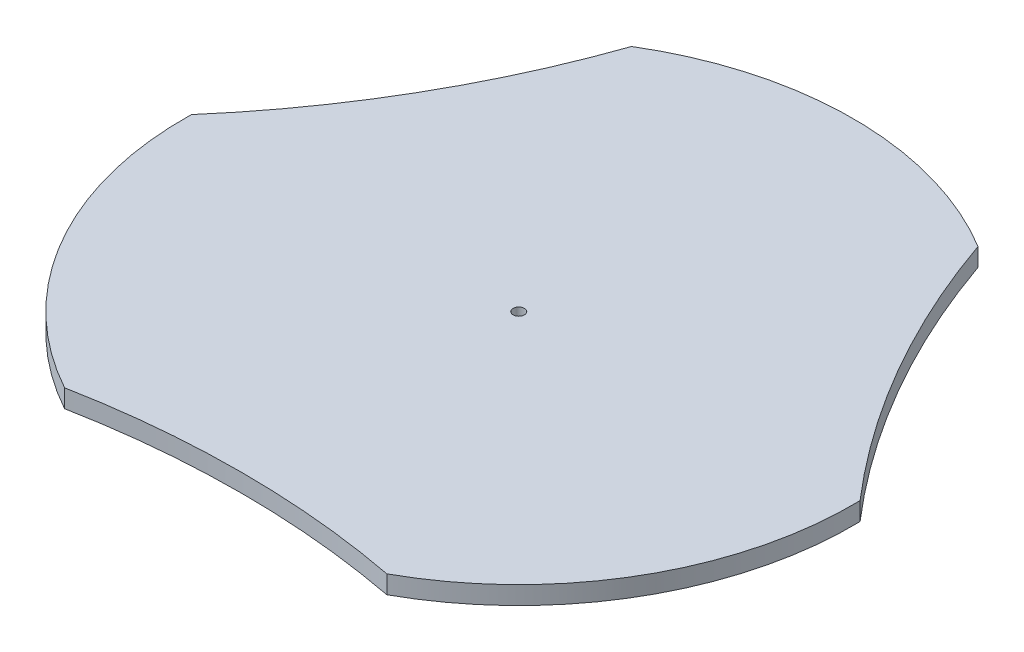
ISO-10303-21;
HEADER;
FILE_DESCRIPTION(('STEP AP214'),'2;1');
FILE_NAME('part.step','',(''),(''),'','','');
FILE_SCHEMA(('AUTOMOTIVE_DESIGN { 1 0 10303 214 1 1 1 1 }'));
ENDSEC;
DATA;
#1=APPLICATION_CONTEXT('core data for automotive mechanical design processes');
#2=APPLICATION_PROTOCOL_DEFINITION('international standard','automotive_design',2000,#1);
#3=PRODUCT_CONTEXT('',#1,'mechanical');
#4=PRODUCT('Part','Part','',(#3));
#5=PRODUCT_RELATED_PRODUCT_CATEGORY('part','',(#4));
#6=PRODUCT_DEFINITION_FORMATION('','',#4);
#7=PRODUCT_DEFINITION_CONTEXT('part definition',#1,'design');
#8=PRODUCT_DEFINITION('design','',#6,#7);
#9=PRODUCT_DEFINITION_SHAPE('','',#8);
#10=(LENGTH_UNIT() NAMED_UNIT(*) SI_UNIT(.MILLI.,.METRE.));
#11=(NAMED_UNIT(*) PLANE_ANGLE_UNIT() SI_UNIT($,.RADIAN.));
#12=(NAMED_UNIT(*) SI_UNIT($,.STERADIAN.) SOLID_ANGLE_UNIT());
#13=UNCERTAINTY_MEASURE_WITH_UNIT(LENGTH_MEASURE(1.E-05),#10,'distance_accuracy_value','');
#14=(GEOMETRIC_REPRESENTATION_CONTEXT(3) GLOBAL_UNCERTAINTY_ASSIGNED_CONTEXT((#13)) GLOBAL_UNIT_ASSIGNED_CONTEXT((#10,
#11,#12)) REPRESENTATION_CONTEXT('',''));
#15=CARTESIAN_POINT('',(0.,0.,0.));
#16=DIRECTION('',(0.,0.,1.));
#17=DIRECTION('',(1.,0.,0.));
#18=AXIS2_PLACEMENT_3D('',#15,#16,#17);
#19=CARTESIAN_POINT('',(0.,1.6,0.));
#20=DIRECTION('',(0.,1.,0.));
#21=DIRECTION('',(0.,0.,1.));
#22=AXIS2_PLACEMENT_3D('',#19,#20,#21);
#23=PLANE('',#22);
#24=CARTESIAN_POINT('',(0.,1.6,0.));
#25=DIRECTION('',(0.,1.,0.));
#26=DIRECTION('',(0.,0.,1.));
#27=AXIS2_PLACEMENT_3D('',#24,#25,#26);
#28=CIRCLE('',#27,0.5);
#29=CARTESIAN_POINT('',(0.,1.6,0.5));
#30=VERTEX_POINT('',#29);
#31=EDGE_CURVE('E118',#30,#30,#28,.T.);
#32=ORIENTED_EDGE('',*,*,#31,.F.);
#33=EDGE_LOOP('',(#32));
#34=FACE_BOUND('',#33,.T.);
#35=CARTESIAN_POINT('',(6.86950496486816E-13,1.6,100.));
#36=DIRECTION('',(0.,1.,0.));
#37=DIRECTION('',(-0.866025403784443,0.,-0.499999999999992));
#38=AXIS2_PLACEMENT_3D('',#35,#36,#37);
#39=CIRCLE('',#38,75.5001398735099);
#40=CARTESIAN_POINT('',(14.2138298760946,1.6,25.8498943954021));
#41=VERTEX_POINT('',#40);
#42=CARTESIAN_POINT('',(-14.2138298760943,1.6,25.8498943954023));
#43=VERTEX_POINT('',#42);
#44=EDGE_CURVE('E106',#41,#43,#39,.T.);
#45=ORIENTED_EDGE('',*,*,#44,.F.);
#46=CARTESIAN_POINT('',(0.,1.6,0.));
#47=DIRECTION('',(0.,1.,0.));
#48=DIRECTION('',(0.,0.,1.));
#49=AXIS2_PLACEMENT_3D('',#46,#47,#48);
#50=CIRCLE('',#49,29.5);
#51=CARTESIAN_POINT('',(29.4935801696105,1.6,-0.615409439933019));
#52=VERTEX_POINT('',#51);
#53=EDGE_CURVE('E62',#41,#52,#50,.T.);
#54=ORIENTED_EDGE('',*,*,#53,.T.);
#55=CARTESIAN_POINT('',(86.602540378444,1.6,-49.9999999999998));
#56=DIRECTION('',(0.,1.,0.));
#57=DIRECTION('',(0.,0.,1.));
#58=AXIS2_PLACEMENT_3D('',#55,#56,#57);
#59=CIRCLE('',#58,75.5001398735099);
#60=CARTESIAN_POINT('',(15.2797502935161,1.6,-25.2344849554691));
#61=VERTEX_POINT('',#60);
#62=EDGE_CURVE('E103',#61,#52,#59,.T.);
#63=ORIENTED_EDGE('',*,*,#62,.F.);
#64=CARTESIAN_POINT('',(-15.2797502935161,1.6,-25.2344849554691));
#65=VERTEX_POINT('',#64);
#66=EDGE_CURVE('E107',#61,#65,#50,.T.);
#67=ORIENTED_EDGE('',*,*,#66,.T.);
#68=CARTESIAN_POINT('',(-86.602540378444,1.6,-49.9999999999998));
#69=DIRECTION('',(0.,1.,0.));
#70=DIRECTION('',(0.866025403784436,0.,-0.500000000000004));
#71=AXIS2_PLACEMENT_3D('',#68,#69,#70);
#72=CIRCLE('',#71,75.5001398735099);
#73=CARTESIAN_POINT('',(-29.4935801696105,1.6,-0.615409439933011));
#74=VERTEX_POINT('',#73);
#75=EDGE_CURVE('E130',#74,#65,#72,.T.);
#76=ORIENTED_EDGE('',*,*,#75,.F.);
#77=EDGE_CURVE('E109',#74,#43,#50,.T.);
#78=ORIENTED_EDGE('',*,*,#77,.T.);
#79=EDGE_LOOP('',(#45,#54,#63,#67,#76,#78));
#80=FACE_BOUND('',#79,.T.);
#81=ADVANCED_FACE('F39',(#34,#80),#23,.T.);
#82=CARTESIAN_POINT('',(0.,0.,0.));
#83=DIRECTION('',(0.,1.,0.));
#84=DIRECTION('',(0.,0.,1.));
#85=AXIS2_PLACEMENT_3D('',#82,#83,#84);
#86=PLANE('',#85);
#87=CARTESIAN_POINT('',(0.,0.,0.));
#88=DIRECTION('',(0.,1.,0.));
#89=DIRECTION('',(0.,0.,1.));
#90=AXIS2_PLACEMENT_3D('',#87,#88,#89);
#91=CIRCLE('',#90,0.5);
#92=CARTESIAN_POINT('',(0.,0.,0.5));
#93=VERTEX_POINT('',#92);
#94=EDGE_CURVE('E114',#93,#93,#91,.T.);
#95=ORIENTED_EDGE('',*,*,#94,.T.);
#96=EDGE_LOOP('',(#95));
#97=FACE_BOUND('',#96,.T.);
#98=CARTESIAN_POINT('',(0.,0.,0.));
#99=DIRECTION('',(0.,1.,0.));
#100=DIRECTION('',(0.,0.,1.));
#101=AXIS2_PLACEMENT_3D('',#98,#99,#100);
#102=CIRCLE('',#101,29.5);
#103=CARTESIAN_POINT('',(14.2138298760946,0.,25.8498943954021));
#104=VERTEX_POINT('',#103);
#105=CARTESIAN_POINT('',(29.4935801696105,0.,-0.61540943993299));
#106=VERTEX_POINT('',#105);
#107=EDGE_CURVE('E92',#104,#106,#102,.T.);
#108=ORIENTED_EDGE('',*,*,#107,.F.);
#109=CARTESIAN_POINT('',(6.86950496486816E-13,0.,100.));
#110=DIRECTION('',(0.,1.,0.));
#111=DIRECTION('',(-0.866025403784443,0.,-0.499999999999992));
#112=AXIS2_PLACEMENT_3D('',#109,#110,#111);
#113=CIRCLE('',#112,75.5001398735099);
#114=CARTESIAN_POINT('',(-14.2138298760943,0.,25.8498943954023));
#115=VERTEX_POINT('',#114);
#116=EDGE_CURVE('E126',#104,#115,#113,.T.);
#117=ORIENTED_EDGE('',*,*,#116,.T.);
#118=CARTESIAN_POINT('',(-29.4935801696105,0.,-0.615409439933011));
#119=VERTEX_POINT('',#118);
#120=EDGE_CURVE('E97',#119,#115,#102,.T.);
#121=ORIENTED_EDGE('',*,*,#120,.F.);
#122=CARTESIAN_POINT('',(-86.602540378444,0.,-49.9999999999998));
#123=DIRECTION('',(0.,1.,0.));
#124=DIRECTION('',(0.866025403784436,0.,-0.500000000000004));
#125=AXIS2_PLACEMENT_3D('',#122,#123,#124);
#126=CIRCLE('',#125,75.5001398735099);
#127=CARTESIAN_POINT('',(-15.2797502935161,0.,-25.2344849554691));
#128=VERTEX_POINT('',#127);
#129=EDGE_CURVE('E133',#119,#128,#126,.T.);
#130=ORIENTED_EDGE('',*,*,#129,.T.);
#131=CARTESIAN_POINT('',(15.2797502935161,0.,-25.2344849554691));
#132=VERTEX_POINT('',#131);
#133=EDGE_CURVE('E54',#132,#128,#102,.T.);
#134=ORIENTED_EDGE('',*,*,#133,.F.);
#135=CARTESIAN_POINT('',(86.602540378444,0.,-49.9999999999998));
#136=DIRECTION('',(0.,1.,0.));
#137=DIRECTION('',(0.,0.,1.));
#138=AXIS2_PLACEMENT_3D('',#135,#136,#137);
#139=CIRCLE('',#138,75.5001398735099);
#140=EDGE_CURVE('E113',#132,#106,#139,.T.);
#141=ORIENTED_EDGE('',*,*,#140,.T.);
#142=EDGE_LOOP('',(#108,#117,#121,#130,#134,#141));
#143=FACE_BOUND('',#142,.T.);
#144=ADVANCED_FACE('F41',(#97,#143),#86,.F.);
#145=CARTESIAN_POINT('',(86.602540378444,0.,-49.9999999999998));
#146=DIRECTION('',(0.,1.,0.));
#147=DIRECTION('',(0.,0.,1.));
#148=AXIS2_PLACEMENT_3D('',#145,#146,#147);
#149=CYLINDRICAL_SURFACE('',#148,75.5001398735099);
#150=DIRECTION('',(0.,1.,0.));
#151=VECTOR('',#150,1.);
#152=CARTESIAN_POINT('',(29.4935801696105,-3.4,-0.615409439932991));
#153=LINE('',#152,#151);
#154=EDGE_CURVE('E89',#106,#52,#153,.T.);
#155=ORIENTED_EDGE('',*,*,#154,.F.);
#156=ORIENTED_EDGE('',*,*,#140,.F.);
#157=DIRECTION('',(0.,1.,0.));
#158=VECTOR('',#157,1.);
#159=CARTESIAN_POINT('',(15.2797502935161,-3.4,-25.2344849554691));
#160=LINE('',#159,#158);
#161=EDGE_CURVE('E112',#61,#132,#160,.F.);
#162=ORIENTED_EDGE('',*,*,#161,.F.);
#163=ORIENTED_EDGE('',*,*,#62,.T.);
#164=EDGE_LOOP('',(#155,#156,#162,#163));
#165=FACE_BOUND('',#164,.T.);
#166=ADVANCED_FACE('F111',(#165),#149,.F.);
#167=CARTESIAN_POINT('',(-86.602540378444,0.,-49.9999999999998));
#168=DIRECTION('',(0.,1.,0.));
#169=DIRECTION('',(0.,0.,1.));
#170=AXIS2_PLACEMENT_3D('',#167,#168,#169);
#171=CYLINDRICAL_SURFACE('',#170,75.5001398735099);
#172=DIRECTION('',(0.,1.,0.));
#173=VECTOR('',#172,1.);
#174=CARTESIAN_POINT('',(-15.2797502935161,-3.4,-25.2344849554691));
#175=LINE('',#174,#173);
#176=EDGE_CURVE('E239',#128,#65,#175,.T.);
#177=ORIENTED_EDGE('',*,*,#176,.F.);
#178=ORIENTED_EDGE('',*,*,#129,.F.);
#179=DIRECTION('',(0.,1.,0.));
#180=VECTOR('',#179,1.);
#181=CARTESIAN_POINT('',(-29.4935801696105,-3.4,-0.615409439933011));
#182=LINE('',#181,#180);
#183=EDGE_CURVE('E240',#74,#119,#182,.F.);
#184=ORIENTED_EDGE('',*,*,#183,.F.);
#185=ORIENTED_EDGE('',*,*,#75,.T.);
#186=EDGE_LOOP('',(#177,#178,#184,#185));
#187=FACE_BOUND('',#186,.T.);
#188=ADVANCED_FACE('F153',(#187),#171,.F.);
#189=CARTESIAN_POINT('',(6.86950496486816E-13,0.,100.));
#190=DIRECTION('',(0.,1.,0.));
#191=DIRECTION('',(0.,0.,1.));
#192=AXIS2_PLACEMENT_3D('',#189,#190,#191);
#193=CYLINDRICAL_SURFACE('',#192,75.5001398735099);
#194=DIRECTION('',(0.,1.,0.));
#195=VECTOR('',#194,1.);
#196=CARTESIAN_POINT('',(-14.2138298760943,-3.4,25.8498943954023));
#197=LINE('',#196,#195);
#198=EDGE_CURVE('E12',#115,#43,#197,.T.);
#199=ORIENTED_EDGE('',*,*,#198,.F.);
#200=ORIENTED_EDGE('',*,*,#116,.F.);
#201=DIRECTION('',(0.,1.,0.));
#202=VECTOR('',#201,1.);
#203=CARTESIAN_POINT('',(14.2138298760946,-3.4,25.8498943954021));
#204=LINE('',#203,#202);
#205=EDGE_CURVE('E47',#41,#104,#204,.F.);
#206=ORIENTED_EDGE('',*,*,#205,.F.);
#207=ORIENTED_EDGE('',*,*,#44,.T.);
#208=EDGE_LOOP('',(#199,#200,#206,#207));
#209=FACE_BOUND('',#208,.T.);
#210=ADVANCED_FACE('F129',(#209),#193,.F.);
#211=CARTESIAN_POINT('',(0.,0.,0.));
#212=DIRECTION('',(0.,1.,0.));
#213=DIRECTION('',(0.,0.,1.));
#214=AXIS2_PLACEMENT_3D('',#211,#212,#213);
#215=CYLINDRICAL_SURFACE('',#214,0.5);
#216=ORIENTED_EDGE('',*,*,#94,.F.);
#217=EDGE_LOOP('',(#216));
#218=FACE_BOUND('',#217,.T.);
#219=ORIENTED_EDGE('',*,*,#31,.T.);
#220=EDGE_LOOP('',(#219));
#221=FACE_BOUND('',#220,.T.);
#222=ADVANCED_FACE('F143',(#218,#221),#215,.F.);
#223=CARTESIAN_POINT('',(0.,-8.4,0.));
#224=DIRECTION('',(0.,1.,0.));
#225=DIRECTION('',(0.,0.,1.));
#226=AXIS2_PLACEMENT_3D('',#223,#224,#225);
#227=CYLINDRICAL_SURFACE('',#226,29.5);
#228=ORIENTED_EDGE('',*,*,#154,.T.);
#229=ORIENTED_EDGE('',*,*,#53,.F.);
#230=ORIENTED_EDGE('',*,*,#205,.T.);
#231=ORIENTED_EDGE('',*,*,#107,.T.);
#232=EDGE_LOOP('',(#228,#229,#230,#231));
#233=FACE_BOUND('',#232,.T.);
#234=ADVANCED_FACE('F90',(#233),#227,.T.);
#235=ORIENTED_EDGE('',*,*,#183,.T.);
#236=ORIENTED_EDGE('',*,*,#120,.T.);
#237=ORIENTED_EDGE('',*,*,#198,.T.);
#238=ORIENTED_EDGE('',*,*,#77,.F.);
#239=EDGE_LOOP('',(#235,#236,#237,#238));
#240=FACE_BOUND('',#239,.T.);
#241=ADVANCED_FACE('F164',(#240),#227,.T.);
#242=ORIENTED_EDGE('',*,*,#161,.T.);
#243=ORIENTED_EDGE('',*,*,#133,.T.);
#244=ORIENTED_EDGE('',*,*,#176,.T.);
#245=ORIENTED_EDGE('',*,*,#66,.F.);
#246=EDGE_LOOP('',(#242,#243,#244,#245));
#247=FACE_BOUND('',#246,.T.);
#248=ADVANCED_FACE('F162',(#247),#227,.T.);
#249=CLOSED_SHELL('',(#81,#144,#166,#188,#210,#222,#234,#241,#248));
#250=MANIFOLD_SOLID_BREP('B2',#249);
#251=ADVANCED_BREP_SHAPE_REPRESENTATION('',(#18,#250),#14);
#252=SHAPE_DEFINITION_REPRESENTATION(#9,#251);
ENDSEC;
END-ISO-10303-21;
